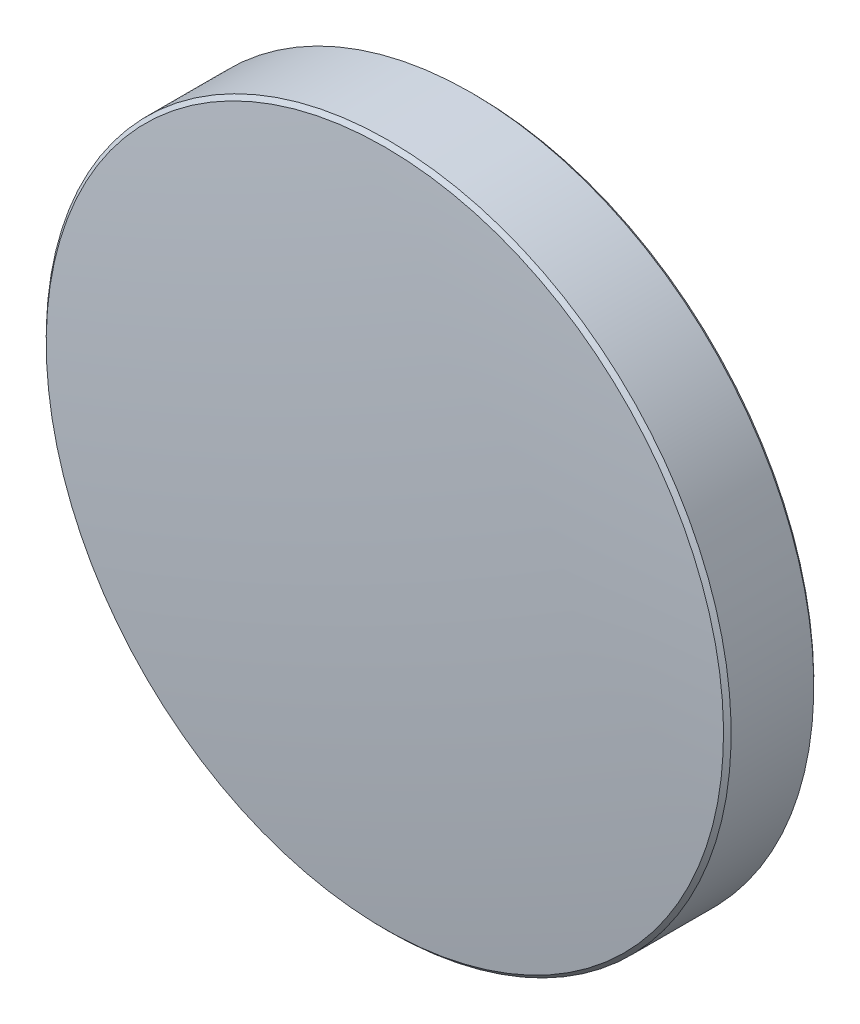
ISO-10303-21;
HEADER;
FILE_DESCRIPTION(('STEP AP214'),'2;1');
FILE_NAME('part.step','',(''),(''),'','','');
FILE_SCHEMA(('AUTOMOTIVE_DESIGN { 1 0 10303 214 1 1 1 1 }'));
ENDSEC;
DATA;
#1=APPLICATION_CONTEXT('core data for automotive mechanical design processes');
#2=APPLICATION_PROTOCOL_DEFINITION('international standard','automotive_design',2000,#1);
#3=PRODUCT_CONTEXT('',#1,'mechanical');
#4=PRODUCT('Part','Part','',(#3));
#5=PRODUCT_RELATED_PRODUCT_CATEGORY('part','',(#4));
#6=PRODUCT_DEFINITION_FORMATION('','',#4);
#7=PRODUCT_DEFINITION_CONTEXT('part definition',#1,'design');
#8=PRODUCT_DEFINITION('design','',#6,#7);
#9=PRODUCT_DEFINITION_SHAPE('','',#8);
#10=(LENGTH_UNIT() NAMED_UNIT(*) SI_UNIT(.MILLI.,.METRE.));
#11=(NAMED_UNIT(*) PLANE_ANGLE_UNIT() SI_UNIT($,.RADIAN.));
#12=(NAMED_UNIT(*) SI_UNIT($,.STERADIAN.) SOLID_ANGLE_UNIT());
#13=UNCERTAINTY_MEASURE_WITH_UNIT(LENGTH_MEASURE(1.E-05),#10,'distance_accuracy_value','');
#14=(GEOMETRIC_REPRESENTATION_CONTEXT(3) GLOBAL_UNCERTAINTY_ASSIGNED_CONTEXT((#13)) GLOBAL_UNIT_ASSIGNED_CONTEXT((#10,
#11,#12)) REPRESENTATION_CONTEXT('',''));
#15=CARTESIAN_POINT('',(0.,0.,0.));
#16=DIRECTION('',(0.,0.,1.));
#17=DIRECTION('',(1.,0.,0.));
#18=AXIS2_PLACEMENT_3D('',#15,#16,#17);
#19=CARTESIAN_POINT('',(0.,0.,-2.));
#20=DIRECTION('',(0.,0.,-1.));
#21=DIRECTION('',(0.,1.,0.));
#22=AXIS2_PLACEMENT_3D('',#19,#20,#21);
#23=PLANE('',#22);
#24=CARTESIAN_POINT('',(0.,0.,-2.));
#25=DIRECTION('',(0.,0.,-1.));
#26=DIRECTION('',(0.,1.,0.));
#27=AXIS2_PLACEMENT_3D('',#24,#25,#26);
#28=CIRCLE('',#27,12.5585786437627);
#29=CARTESIAN_POINT('',(0.,12.5585786437627,-2.));
#30=VERTEX_POINT('',#29);
#31=EDGE_CURVE('E27',#30,#30,#28,.T.);
#32=ORIENTED_EDGE('',*,*,#31,.T.);
#33=EDGE_LOOP('',(#32));
#34=FACE_BOUND('',#33,.T.);
#35=ADVANCED_FACE('F13',(#34),#23,.T.);
#36=CARTESIAN_POINT('',(0.,0.,-119.28));
#37=DIRECTION('',(0.,0.,-1.));
#38=DIRECTION('',(0.,1.,0.));
#39=AXIS2_PLACEMENT_3D('',#36,#37,#38);
#40=SPHERICAL_SURFACE('',#39,121.28);
#41=CARTESIAN_POINT('',(0.,0.,1.34802536081095));
#42=DIRECTION('',(0.,0.,-1.));
#43=DIRECTION('',(0.,1.,0.));
#44=AXIS2_PLACEMENT_3D('',#41,#42,#43);
#45=CIRCLE('',#44,12.5585786437627);
#46=CARTESIAN_POINT('',(0.,12.5585786437627,1.34802536081095));
#47=VERTEX_POINT('',#46);
#48=EDGE_CURVE('E9',#47,#47,#45,.T.);
#49=ORIENTED_EDGE('',*,*,#48,.F.);
#50=EDGE_LOOP('',(#49));
#51=FACE_BOUND('',#50,.T.);
#52=ADVANCED_FACE('F46',(#51),#40,.T.);
#53=CARTESIAN_POINT('',(0.,0.,1.20660400457372));
#54=DIRECTION('',(0.,0.,-1.));
#55=DIRECTION('',(0.,1.,0.));
#56=AXIS2_PLACEMENT_3D('',#53,#54,#55);
#57=CONICAL_SURFACE('',#56,12.7,0.78539816339778);
#58=ORIENTED_EDGE('',*,*,#48,.T.);
#59=EDGE_LOOP('',(#58));
#60=FACE_BOUND('',#59,.T.);
#61=CARTESIAN_POINT('',(0.,0.,1.20660400457372));
#62=DIRECTION('',(0.,0.,-1.));
#63=DIRECTION('',(0.,1.,0.));
#64=AXIS2_PLACEMENT_3D('',#61,#62,#63);
#65=CIRCLE('',#64,12.7);
#66=CARTESIAN_POINT('',(0.,12.7,1.20660400457373));
#67=VERTEX_POINT('',#66);
#68=EDGE_CURVE('E19',#67,#67,#65,.T.);
#69=ORIENTED_EDGE('',*,*,#68,.F.);
#70=EDGE_LOOP('',(#69));
#71=FACE_BOUND('',#70,.T.);
#72=ADVANCED_FACE('F43',(#60,#71),#57,.T.);
#73=CARTESIAN_POINT('',(0.,0.,-2.));
#74=DIRECTION('',(0.,0.,-1.));
#75=DIRECTION('',(0.,1.,0.));
#76=AXIS2_PLACEMENT_3D('',#73,#74,#75);
#77=CYLINDRICAL_SURFACE('',#76,12.7);
#78=ORIENTED_EDGE('',*,*,#68,.T.);
#79=EDGE_LOOP('',(#78));
#80=FACE_BOUND('',#79,.T.);
#81=CARTESIAN_POINT('',(0.,0.,-1.85857864376269));
#82=DIRECTION('',(0.,0.,-1.));
#83=DIRECTION('',(0.,1.,0.));
#84=AXIS2_PLACEMENT_3D('',#81,#82,#83);
#85=CIRCLE('',#84,12.7);
#86=CARTESIAN_POINT('',(0.,12.7,-1.85857864376269));
#87=VERTEX_POINT('',#86);
#88=EDGE_CURVE('E23',#87,#87,#85,.T.);
#89=ORIENTED_EDGE('',*,*,#88,.F.);
#90=EDGE_LOOP('',(#89));
#91=FACE_BOUND('',#90,.T.);
#92=ADVANCED_FACE('F36',(#80,#91),#77,.T.);
#93=CARTESIAN_POINT('',(0.,0.,-2.));
#94=DIRECTION('',(0.,0.,1.));
#95=DIRECTION('',(0.,-1.,0.));
#96=AXIS2_PLACEMENT_3D('',#93,#94,#95);
#97=CONICAL_SURFACE('',#96,12.5585786437627,0.785398163397439);
#98=ORIENTED_EDGE('',*,*,#88,.T.);
#99=EDGE_LOOP('',(#98));
#100=FACE_BOUND('',#99,.T.);
#101=ORIENTED_EDGE('',*,*,#31,.F.);
#102=EDGE_LOOP('',(#101));
#103=FACE_BOUND('',#102,.T.);
#104=ADVANCED_FACE('F34',(#100,#103),#97,.T.);
#105=CLOSED_SHELL('',(#35,#52,#72,#92,#104));
#106=MANIFOLD_SOLID_BREP('B1',#105);
#107=ADVANCED_BREP_SHAPE_REPRESENTATION('',(#18,#106),#14);
#108=SHAPE_DEFINITION_REPRESENTATION(#9,#107);
ENDSEC;
END-ISO-10303-21;
